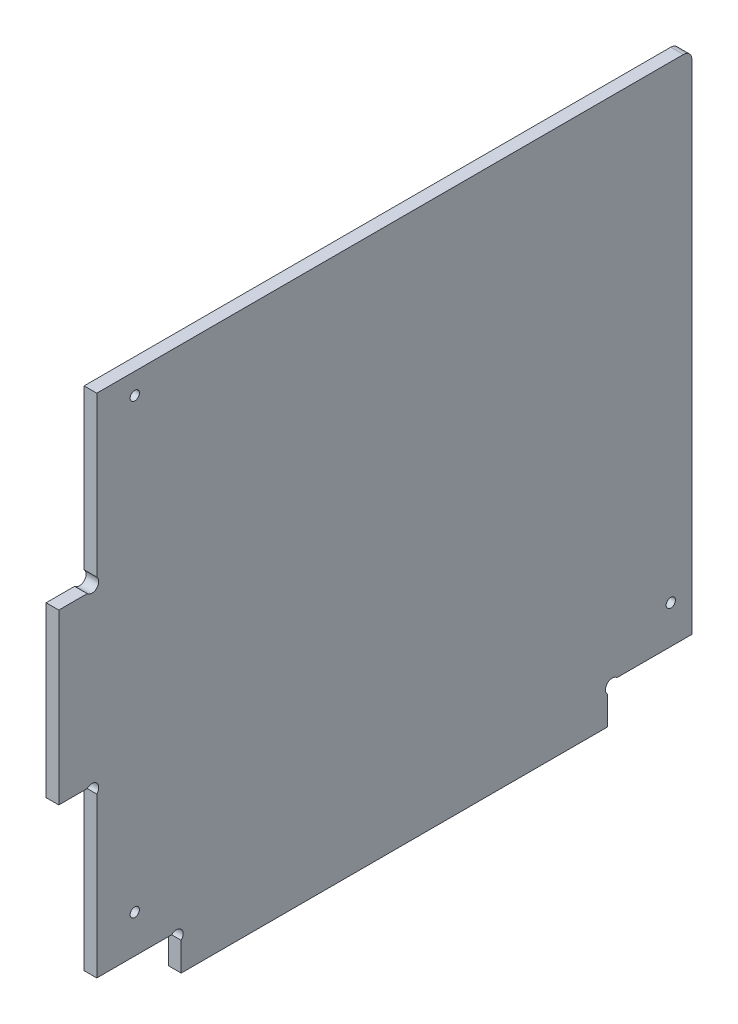
ISO-10303-21;
HEADER;
FILE_DESCRIPTION(('STEP AP214'),'2;1');
FILE_NAME('part.step','',(''),(''),'','','');
FILE_SCHEMA(('AUTOMOTIVE_DESIGN { 1 0 10303 214 1 1 1 1 }'));
ENDSEC;
DATA;
#1=APPLICATION_CONTEXT('core data for automotive mechanical design processes');
#2=APPLICATION_PROTOCOL_DEFINITION('international standard','automotive_design',2000,#1);
#3=PRODUCT_CONTEXT('',#1,'mechanical');
#4=PRODUCT('Part','Part','',(#3));
#5=PRODUCT_RELATED_PRODUCT_CATEGORY('part','',(#4));
#6=PRODUCT_DEFINITION_FORMATION('','',#4);
#7=PRODUCT_DEFINITION_CONTEXT('part definition',#1,'design');
#8=PRODUCT_DEFINITION('design','',#6,#7);
#9=PRODUCT_DEFINITION_SHAPE('','',#8);
#10=(LENGTH_UNIT() NAMED_UNIT(*) SI_UNIT(.MILLI.,.METRE.));
#11=(NAMED_UNIT(*) PLANE_ANGLE_UNIT() SI_UNIT($,.RADIAN.));
#12=(NAMED_UNIT(*) SI_UNIT($,.STERADIAN.) SOLID_ANGLE_UNIT());
#13=UNCERTAINTY_MEASURE_WITH_UNIT(LENGTH_MEASURE(1.E-05),#10,'distance_accuracy_value','');
#14=(GEOMETRIC_REPRESENTATION_CONTEXT(3) GLOBAL_UNCERTAINTY_ASSIGNED_CONTEXT((#13)) GLOBAL_UNIT_ASSIGNED_CONTEXT((#10,
#11,#12)) REPRESENTATION_CONTEXT('',''));
#15=CARTESIAN_POINT('',(0.,0.,0.));
#16=DIRECTION('',(0.,0.,1.));
#17=DIRECTION('',(1.,0.,0.));
#18=AXIS2_PLACEMENT_3D('',#15,#16,#17);
#19=CARTESIAN_POINT('',(3.,7.8686291501015,-131.131370849898));
#20=DIRECTION('',(-1.,0.,0.));
#21=DIRECTION('',(0.,0.,1.));
#22=AXIS2_PLACEMENT_3D('',#19,#20,#21);
#23=CYLINDRICAL_SURFACE('',#22,1.6);
#24=CARTESIAN_POINT('',(0.,7.8686291501015,-131.131370849898));
#25=DIRECTION('',(-1.,0.,0.));
#26=DIRECTION('',(0.,0.,-1.));
#27=AXIS2_PLACEMENT_3D('',#24,#25,#26);
#28=CIRCLE('',#27,1.6);
#29=CARTESIAN_POINT('',(0.,6.73725830020302,-130.));
#30=VERTEX_POINT('',#29);
#31=CARTESIAN_POINT('',(0.,9.,-132.262741699797));
#32=VERTEX_POINT('',#31);
#33=EDGE_CURVE('E176',#30,#32,#28,.T.);
#34=ORIENTED_EDGE('',*,*,#33,.T.);
#35=DIRECTION('',(-1.,0.,0.));
#36=VECTOR('',#35,1.);
#37=CARTESIAN_POINT('',(3.,9.,-132.262741699797));
#38=LINE('',#37,#36);
#39=CARTESIAN_POINT('',(3.,9.,-132.262741699797));
#40=VERTEX_POINT('',#39);
#41=EDGE_CURVE('E158',#40,#32,#38,.T.);
#42=ORIENTED_EDGE('',*,*,#41,.F.);
#43=CARTESIAN_POINT('',(3.,7.8686291501015,-131.131370849898));
#44=DIRECTION('',(-1.,0.,0.));
#45=DIRECTION('',(0.,0.,-1.));
#46=AXIS2_PLACEMENT_3D('',#43,#44,#45);
#47=CIRCLE('',#46,1.6);
#48=CARTESIAN_POINT('',(3.,6.73725830020302,-130.));
#49=VERTEX_POINT('',#48);
#50=EDGE_CURVE('E164',#49,#40,#47,.T.);
#51=ORIENTED_EDGE('',*,*,#50,.F.);
#52=DIRECTION('',(-1.,0.,0.));
#53=VECTOR('',#52,1.);
#54=CARTESIAN_POINT('',(3.,6.73725830020302,-130.));
#55=LINE('',#54,#53);
#56=EDGE_CURVE('E220',#49,#30,#55,.T.);
#57=ORIENTED_EDGE('',*,*,#56,.T.);
#58=EDGE_LOOP('',(#34,#42,#51,#57));
#59=FACE_BOUND('',#58,.T.);
#60=ADVANCED_FACE('F35',(#59),#23,.F.);
#61=CARTESIAN_POINT('',(3.,8.99999999999999,-150.));
#62=DIRECTION('',(0.,1.,0.));
#63=DIRECTION('',(0.,0.,1.));
#64=AXIS2_PLACEMENT_3D('',#61,#62,#63);
#65=PLANE('',#64);
#66=DIRECTION('',(0.,0.,-1.));
#67=VECTOR('',#66,1.);
#68=CARTESIAN_POINT('',(0.,8.99999999999999,-150.));
#69=LINE('',#68,#67);
#70=CARTESIAN_POINT('',(0.,8.99999999999999,-150.));
#71=VERTEX_POINT('',#70);
#72=EDGE_CURVE('E249',#32,#71,#69,.T.);
#73=ORIENTED_EDGE('',*,*,#72,.T.);
#74=DIRECTION('',(-1.,0.,0.));
#75=VECTOR('',#74,1.);
#76=CARTESIAN_POINT('',(3.,8.99999999999999,-150.));
#77=LINE('',#76,#75);
#78=CARTESIAN_POINT('',(3.,8.99999999999999,-150.));
#79=VERTEX_POINT('',#78);
#80=EDGE_CURVE('E161',#79,#71,#77,.T.);
#81=ORIENTED_EDGE('',*,*,#80,.F.);
#82=DIRECTION('',(0.,0.,-1.));
#83=VECTOR('',#82,1.);
#84=CARTESIAN_POINT('',(3.,8.99999999999999,-150.));
#85=LINE('',#84,#83);
#86=EDGE_CURVE('E154',#40,#79,#85,.T.);
#87=ORIENTED_EDGE('',*,*,#86,.F.);
#88=ORIENTED_EDGE('',*,*,#41,.T.);
#89=EDGE_LOOP('',(#73,#81,#87,#88));
#90=FACE_BOUND('',#89,.T.);
#91=ADVANCED_FACE('F156',(#90),#65,.F.);
#92=CARTESIAN_POINT('',(3.,129.,-150.));
#93=DIRECTION('',(0.,0.,1.));
#94=DIRECTION('',(0.,-1.,0.));
#95=AXIS2_PLACEMENT_3D('',#92,#93,#94);
#96=PLANE('',#95);
#97=DIRECTION('',(0.,1.,0.));
#98=VECTOR('',#97,1.);
#99=CARTESIAN_POINT('',(0.,129.,-150.));
#100=LINE('',#99,#98);
#101=CARTESIAN_POINT('',(0.,127.,-150.));
#102=VERTEX_POINT('',#101);
#103=EDGE_CURVE('E247',#71,#102,#100,.T.);
#104=ORIENTED_EDGE('',*,*,#103,.T.);
#105=DIRECTION('',(-1.,0.,0.));
#106=VECTOR('',#105,1.);
#107=CARTESIAN_POINT('',(3.,127.,-150.));
#108=LINE('',#107,#106);
#109=CARTESIAN_POINT('',(3.,127.,-150.));
#110=VERTEX_POINT('',#109);
#111=EDGE_CURVE('E43',#102,#110,#108,.F.);
#112=ORIENTED_EDGE('',*,*,#111,.T.);
#113=DIRECTION('',(0.,1.,0.));
#114=VECTOR('',#113,1.);
#115=CARTESIAN_POINT('',(3.,129.,-150.));
#116=LINE('',#115,#114);
#117=EDGE_CURVE('E163',#79,#110,#116,.T.);
#118=ORIENTED_EDGE('',*,*,#117,.F.);
#119=ORIENTED_EDGE('',*,*,#80,.T.);
#120=EDGE_LOOP('',(#104,#112,#118,#119));
#121=FACE_BOUND('',#120,.T.);
#122=ADVANCED_FACE('F331',(#121),#96,.F.);
#123=CARTESIAN_POINT('',(3.,129.,-8.99999999999997));
#124=DIRECTION('',(0.,-1.,0.));
#125=DIRECTION('',(0.,0.,-1.));
#126=AXIS2_PLACEMENT_3D('',#123,#124,#125);
#127=PLANE('',#126);
#128=DIRECTION('',(0.,0.,1.));
#129=VECTOR('',#128,1.);
#130=CARTESIAN_POINT('',(3.,129.,-8.99999999999997));
#131=LINE('',#130,#129);
#132=CARTESIAN_POINT('',(3.,129.,-148.));
#133=VERTEX_POINT('',#132);
#134=CARTESIAN_POINT('',(3.,129.,-8.99999999999997));
#135=VERTEX_POINT('',#134);
#136=EDGE_CURVE('E276',#133,#135,#131,.T.);
#137=ORIENTED_EDGE('',*,*,#136,.F.);
#138=DIRECTION('',(-1.,0.,0.));
#139=VECTOR('',#138,1.);
#140=CARTESIAN_POINT('',(3.,129.,-148.));
#141=LINE('',#140,#139);
#142=CARTESIAN_POINT('',(0.,129.,-148.));
#143=VERTEX_POINT('',#142);
#144=EDGE_CURVE('E177',#133,#143,#141,.T.);
#145=ORIENTED_EDGE('',*,*,#144,.T.);
#146=DIRECTION('',(0.,0.,1.));
#147=VECTOR('',#146,1.);
#148=CARTESIAN_POINT('',(0.,129.,-8.99999999999997));
#149=LINE('',#148,#147);
#150=CARTESIAN_POINT('',(0.,129.,-8.99999999999997));
#151=VERTEX_POINT('',#150);
#152=EDGE_CURVE('E245',#143,#151,#149,.T.);
#153=ORIENTED_EDGE('',*,*,#152,.T.);
#154=DIRECTION('',(-1.,0.,0.));
#155=VECTOR('',#154,1.);
#156=CARTESIAN_POINT('',(3.,129.,-8.99999999999997));
#157=LINE('',#156,#155);
#158=EDGE_CURVE('E181',#135,#151,#157,.T.);
#159=ORIENTED_EDGE('',*,*,#158,.F.);
#160=EDGE_LOOP('',(#137,#145,#153,#159));
#161=FACE_BOUND('',#160,.T.);
#162=ADVANCED_FACE('F336',(#161),#127,.F.);
#163=CARTESIAN_POINT('',(3.,91.2627416997969,-8.99999999999998));
#164=DIRECTION('',(0.,0.,-1.));
#165=DIRECTION('',(0.,1.,0.));
#166=AXIS2_PLACEMENT_3D('',#163,#164,#165);
#167=PLANE('',#166);
#168=DIRECTION('',(0.,-1.,0.));
#169=VECTOR('',#168,1.);
#170=CARTESIAN_POINT('',(0.,91.2627416997969,-8.99999999999998));
#171=LINE('',#170,#169);
#172=CARTESIAN_POINT('',(0.,91.2627416997969,-8.99999999999998));
#173=VERTEX_POINT('',#172);
#174=EDGE_CURVE('E243',#151,#173,#171,.T.);
#175=ORIENTED_EDGE('',*,*,#174,.T.);
#176=DIRECTION('',(-1.,0.,0.));
#177=VECTOR('',#176,1.);
#178=CARTESIAN_POINT('',(3.,91.2627416997969,-8.99999999999998));
#179=LINE('',#178,#177);
#180=CARTESIAN_POINT('',(3.,91.2627416997969,-8.99999999999998));
#181=VERTEX_POINT('',#180);
#182=EDGE_CURVE('E187',#181,#173,#179,.T.);
#183=ORIENTED_EDGE('',*,*,#182,.F.);
#184=DIRECTION('',(0.,-1.,0.));
#185=VECTOR('',#184,1.);
#186=CARTESIAN_POINT('',(3.,91.2627416997969,-8.99999999999998));
#187=LINE('',#186,#185);
#188=EDGE_CURVE('E274',#135,#181,#187,.T.);
#189=ORIENTED_EDGE('',*,*,#188,.F.);
#190=ORIENTED_EDGE('',*,*,#158,.T.);
#191=EDGE_LOOP('',(#175,#183,#189,#190));
#192=FACE_BOUND('',#191,.T.);
#193=ADVANCED_FACE('F339',(#192),#167,.F.);
#194=CARTESIAN_POINT('',(3.,90.1313708498985,-7.86862915010151));
#195=DIRECTION('',(-1.,0.,0.));
#196=DIRECTION('',(0.,0.,1.));
#197=AXIS2_PLACEMENT_3D('',#194,#195,#196);
#198=CYLINDRICAL_SURFACE('',#197,1.6);
#199=CARTESIAN_POINT('',(0.,90.1313708498985,-7.86862915010151));
#200=DIRECTION('',(-1.,0.,0.));
#201=DIRECTION('',(0.,0.,1.));
#202=AXIS2_PLACEMENT_3D('',#199,#200,#201);
#203=CIRCLE('',#202,1.6);
#204=CARTESIAN_POINT('',(0.,89.,-6.73725830020303));
#205=VERTEX_POINT('',#204);
#206=EDGE_CURVE('E241',#173,#205,#203,.T.);
#207=ORIENTED_EDGE('',*,*,#206,.T.);
#208=DIRECTION('',(-1.,0.,0.));
#209=VECTOR('',#208,1.);
#210=CARTESIAN_POINT('',(3.,89.,-6.73725830020303));
#211=LINE('',#210,#209);
#212=CARTESIAN_POINT('',(3.,89.,-6.73725830020303));
#213=VERTEX_POINT('',#212);
#214=EDGE_CURVE('E190',#213,#205,#211,.T.);
#215=ORIENTED_EDGE('',*,*,#214,.F.);
#216=CARTESIAN_POINT('',(3.,90.1313708498985,-7.86862915010151));
#217=DIRECTION('',(-1.,0.,0.));
#218=DIRECTION('',(0.,0.,1.));
#219=AXIS2_PLACEMENT_3D('',#216,#217,#218);
#220=CIRCLE('',#219,1.6);
#221=EDGE_CURVE('E272',#181,#213,#220,.T.);
#222=ORIENTED_EDGE('',*,*,#221,.F.);
#223=ORIENTED_EDGE('',*,*,#182,.T.);
#224=EDGE_LOOP('',(#207,#215,#222,#223));
#225=FACE_BOUND('',#224,.T.);
#226=ADVANCED_FACE('F343',(#225),#198,.F.);
#227=CARTESIAN_POINT('',(3.,89.,0.));
#228=DIRECTION('',(0.,-1.,0.));
#229=DIRECTION('',(0.,0.,-1.));
#230=AXIS2_PLACEMENT_3D('',#227,#228,#229);
#231=PLANE('',#230);
#232=DIRECTION('',(0.,0.,1.));
#233=VECTOR('',#232,1.);
#234=CARTESIAN_POINT('',(0.,89.,0.));
#235=LINE('',#234,#233);
#236=CARTESIAN_POINT('',(0.,89.,0.));
#237=VERTEX_POINT('',#236);
#238=EDGE_CURVE('E239',#205,#237,#235,.T.);
#239=ORIENTED_EDGE('',*,*,#238,.T.);
#240=DIRECTION('',(-1.,0.,0.));
#241=VECTOR('',#240,1.);
#242=CARTESIAN_POINT('',(3.,89.,0.));
#243=LINE('',#242,#241);
#244=CARTESIAN_POINT('',(3.,89.,0.));
#245=VERTEX_POINT('',#244);
#246=EDGE_CURVE('E193',#245,#237,#243,.T.);
#247=ORIENTED_EDGE('',*,*,#246,.F.);
#248=DIRECTION('',(0.,0.,1.));
#249=VECTOR('',#248,1.);
#250=CARTESIAN_POINT('',(3.,89.,0.));
#251=LINE('',#250,#249);
#252=EDGE_CURVE('E270',#213,#245,#251,.T.);
#253=ORIENTED_EDGE('',*,*,#252,.F.);
#254=ORIENTED_EDGE('',*,*,#214,.T.);
#255=EDGE_LOOP('',(#239,#247,#253,#254));
#256=FACE_BOUND('',#255,.T.);
#257=ADVANCED_FACE('F347',(#256),#231,.F.);
#258=CARTESIAN_POINT('',(3.,49.,0.));
#259=DIRECTION('',(0.,0.,-1.));
#260=DIRECTION('',(-1.,0.,0.));
#261=AXIS2_PLACEMENT_3D('',#258,#259,#260);
#262=PLANE('',#261);
#263=DIRECTION('',(0.,-1.,0.));
#264=VECTOR('',#263,1.);
#265=CARTESIAN_POINT('',(0.,49.,0.));
#266=LINE('',#265,#264);
#267=CARTESIAN_POINT('',(0.,49.,0.));
#268=VERTEX_POINT('',#267);
#269=EDGE_CURVE('E237',#237,#268,#266,.T.);
#270=ORIENTED_EDGE('',*,*,#269,.T.);
#271=DIRECTION('',(-1.,0.,0.));
#272=VECTOR('',#271,1.);
#273=CARTESIAN_POINT('',(3.,49.,0.));
#274=LINE('',#273,#272);
#275=CARTESIAN_POINT('',(3.,49.,0.));
#276=VERTEX_POINT('',#275);
#277=EDGE_CURVE('E196',#276,#268,#274,.T.);
#278=ORIENTED_EDGE('',*,*,#277,.F.);
#279=DIRECTION('',(0.,-1.,0.));
#280=VECTOR('',#279,1.);
#281=CARTESIAN_POINT('',(3.,49.,0.));
#282=LINE('',#281,#280);
#283=EDGE_CURVE('E268',#245,#276,#282,.T.);
#284=ORIENTED_EDGE('',*,*,#283,.F.);
#285=ORIENTED_EDGE('',*,*,#246,.T.);
#286=EDGE_LOOP('',(#270,#278,#284,#285));
#287=FACE_BOUND('',#286,.T.);
#288=ADVANCED_FACE('F351',(#287),#262,.F.);
#289=CARTESIAN_POINT('',(3.,49.,0.));
#290=DIRECTION('',(0.,1.,0.));
#291=DIRECTION('',(0.,0.,1.));
#292=AXIS2_PLACEMENT_3D('',#289,#290,#291);
#293=PLANE('',#292);
#294=DIRECTION('',(0.,0.,-1.));
#295=VECTOR('',#294,1.);
#296=CARTESIAN_POINT('',(0.,49.,0.));
#297=LINE('',#296,#295);
#298=CARTESIAN_POINT('',(0.,49.,-6.73725830020302));
#299=VERTEX_POINT('',#298);
#300=EDGE_CURVE('E235',#268,#299,#297,.T.);
#301=ORIENTED_EDGE('',*,*,#300,.T.);
#302=DIRECTION('',(-1.,0.,0.));
#303=VECTOR('',#302,1.);
#304=CARTESIAN_POINT('',(3.,49.,-6.73725830020302));
#305=LINE('',#304,#303);
#306=CARTESIAN_POINT('',(3.,49.,-6.73725830020302));
#307=VERTEX_POINT('',#306);
#308=EDGE_CURVE('E199',#307,#299,#305,.T.);
#309=ORIENTED_EDGE('',*,*,#308,.F.);
#310=DIRECTION('',(0.,0.,-1.));
#311=VECTOR('',#310,1.);
#312=CARTESIAN_POINT('',(3.,49.,0.));
#313=LINE('',#312,#311);
#314=EDGE_CURVE('E266',#276,#307,#313,.T.);
#315=ORIENTED_EDGE('',*,*,#314,.F.);
#316=ORIENTED_EDGE('',*,*,#277,.T.);
#317=EDGE_LOOP('',(#301,#309,#315,#316));
#318=FACE_BOUND('',#317,.T.);
#319=ADVANCED_FACE('F355',(#318),#293,.F.);
#320=CARTESIAN_POINT('',(3.,47.8686291501015,-7.86862915010151));
#321=DIRECTION('',(-1.,0.,0.));
#322=DIRECTION('',(0.,0.,1.));
#323=AXIS2_PLACEMENT_3D('',#320,#321,#322);
#324=CYLINDRICAL_SURFACE('',#323,1.6);
#325=CARTESIAN_POINT('',(0.,47.8686291501015,-7.86862915010151));
#326=DIRECTION('',(-1.,0.,0.));
#327=DIRECTION('',(0.,0.,-1.));
#328=AXIS2_PLACEMENT_3D('',#325,#326,#327);
#329=CIRCLE('',#328,1.6);
#330=CARTESIAN_POINT('',(0.,46.7372583002031,-8.99999999999999));
#331=VERTEX_POINT('',#330);
#332=EDGE_CURVE('E233',#299,#331,#329,.T.);
#333=ORIENTED_EDGE('',*,*,#332,.T.);
#334=DIRECTION('',(-1.,0.,0.));
#335=VECTOR('',#334,1.);
#336=CARTESIAN_POINT('',(3.,46.7372583002031,-8.99999999999999));
#337=LINE('',#336,#335);
#338=CARTESIAN_POINT('',(3.,46.7372583002031,-8.99999999999999));
#339=VERTEX_POINT('',#338);
#340=EDGE_CURVE('E202',#339,#331,#337,.T.);
#341=ORIENTED_EDGE('',*,*,#340,.F.);
#342=CARTESIAN_POINT('',(3.,47.8686291501015,-7.86862915010151));
#343=DIRECTION('',(-1.,0.,0.));
#344=DIRECTION('',(0.,0.,-1.));
#345=AXIS2_PLACEMENT_3D('',#342,#343,#344);
#346=CIRCLE('',#345,1.6);
#347=EDGE_CURVE('E264',#307,#339,#346,.T.);
#348=ORIENTED_EDGE('',*,*,#347,.F.);
#349=ORIENTED_EDGE('',*,*,#308,.T.);
#350=EDGE_LOOP('',(#333,#341,#348,#349));
#351=FACE_BOUND('',#350,.T.);
#352=ADVANCED_FACE('F359',(#351),#324,.F.);
#353=CARTESIAN_POINT('',(3.,8.99999999999998,-9.));
#354=DIRECTION('',(0.,0.,-1.));
#355=DIRECTION('',(0.,1.,0.));
#356=AXIS2_PLACEMENT_3D('',#353,#354,#355);
#357=PLANE('',#356);
#358=DIRECTION('',(0.,-1.,0.));
#359=VECTOR('',#358,1.);
#360=CARTESIAN_POINT('',(0.,8.99999999999998,-9.));
#361=LINE('',#360,#359);
#362=CARTESIAN_POINT('',(0.,8.99999999999998,-9.));
#363=VERTEX_POINT('',#362);
#364=EDGE_CURVE('E231',#331,#363,#361,.T.);
#365=ORIENTED_EDGE('',*,*,#364,.T.);
#366=DIRECTION('',(-1.,0.,0.));
#367=VECTOR('',#366,1.);
#368=CARTESIAN_POINT('',(3.,8.99999999999998,-9.));
#369=LINE('',#368,#367);
#370=CARTESIAN_POINT('',(3.,8.99999999999998,-9.));
#371=VERTEX_POINT('',#370);
#372=EDGE_CURVE('E205',#371,#363,#369,.T.);
#373=ORIENTED_EDGE('',*,*,#372,.F.);
#374=DIRECTION('',(0.,-1.,0.));
#375=VECTOR('',#374,1.);
#376=CARTESIAN_POINT('',(3.,8.99999999999998,-9.));
#377=LINE('',#376,#375);
#378=EDGE_CURVE('E262',#339,#371,#377,.T.);
#379=ORIENTED_EDGE('',*,*,#378,.F.);
#380=ORIENTED_EDGE('',*,*,#340,.T.);
#381=EDGE_LOOP('',(#365,#373,#379,#380));
#382=FACE_BOUND('',#381,.T.);
#383=ADVANCED_FACE('F363',(#382),#357,.F.);
#384=CARTESIAN_POINT('',(3.,8.99999999999998,-26.737258300203));
#385=DIRECTION('',(0.,1.,0.));
#386=DIRECTION('',(0.,0.,1.));
#387=AXIS2_PLACEMENT_3D('',#384,#385,#386);
#388=PLANE('',#387);
#389=DIRECTION('',(0.,0.,-1.));
#390=VECTOR('',#389,1.);
#391=CARTESIAN_POINT('',(0.,8.99999999999998,-26.737258300203));
#392=LINE('',#391,#390);
#393=CARTESIAN_POINT('',(0.,8.99999999999998,-26.737258300203));
#394=VERTEX_POINT('',#393);
#395=EDGE_CURVE('E229',#363,#394,#392,.T.);
#396=ORIENTED_EDGE('',*,*,#395,.T.);
#397=DIRECTION('',(-1.,0.,0.));
#398=VECTOR('',#397,1.);
#399=CARTESIAN_POINT('',(3.,8.99999999999998,-26.737258300203));
#400=LINE('',#399,#398);
#401=CARTESIAN_POINT('',(3.,8.99999999999998,-26.737258300203));
#402=VERTEX_POINT('',#401);
#403=EDGE_CURVE('E208',#402,#394,#400,.T.);
#404=ORIENTED_EDGE('',*,*,#403,.F.);
#405=DIRECTION('',(0.,0.,-1.));
#406=VECTOR('',#405,1.);
#407=CARTESIAN_POINT('',(3.,8.99999999999998,-26.737258300203));
#408=LINE('',#407,#406);
#409=EDGE_CURVE('E260',#371,#402,#408,.T.);
#410=ORIENTED_EDGE('',*,*,#409,.F.);
#411=ORIENTED_EDGE('',*,*,#372,.T.);
#412=EDGE_LOOP('',(#396,#404,#410,#411));
#413=FACE_BOUND('',#412,.T.);
#414=ADVANCED_FACE('F367',(#413),#388,.F.);
#415=CARTESIAN_POINT('',(3.,7.8686291501015,-27.8686291501015));
#416=DIRECTION('',(-1.,0.,0.));
#417=DIRECTION('',(0.,0.,1.));
#418=AXIS2_PLACEMENT_3D('',#415,#416,#417);
#419=CYLINDRICAL_SURFACE('',#418,1.6);
#420=CARTESIAN_POINT('',(0.,7.8686291501015,-27.8686291501015));
#421=DIRECTION('',(-1.,0.,0.));
#422=DIRECTION('',(0.,0.,1.));
#423=AXIS2_PLACEMENT_3D('',#420,#421,#422);
#424=CIRCLE('',#423,1.6);
#425=CARTESIAN_POINT('',(0.,6.73725830020306,-29.));
#426=VERTEX_POINT('',#425);
#427=EDGE_CURVE('E227',#394,#426,#424,.T.);
#428=ORIENTED_EDGE('',*,*,#427,.T.);
#429=DIRECTION('',(-1.,0.,0.));
#430=VECTOR('',#429,1.);
#431=CARTESIAN_POINT('',(3.,6.73725830020306,-29.));
#432=LINE('',#431,#430);
#433=CARTESIAN_POINT('',(3.,6.73725830020306,-29.));
#434=VERTEX_POINT('',#433);
#435=EDGE_CURVE('E211',#434,#426,#432,.T.);
#436=ORIENTED_EDGE('',*,*,#435,.F.);
#437=CARTESIAN_POINT('',(3.,7.8686291501015,-27.8686291501015));
#438=DIRECTION('',(-1.,0.,0.));
#439=DIRECTION('',(0.,0.,1.));
#440=AXIS2_PLACEMENT_3D('',#437,#438,#439);
#441=CIRCLE('',#440,1.6);
#442=EDGE_CURVE('E258',#402,#434,#441,.T.);
#443=ORIENTED_EDGE('',*,*,#442,.F.);
#444=ORIENTED_EDGE('',*,*,#403,.T.);
#445=EDGE_LOOP('',(#428,#436,#443,#444));
#446=FACE_BOUND('',#445,.T.);
#447=ADVANCED_FACE('F371',(#446),#419,.F.);
#448=CARTESIAN_POINT('',(3.,6.73725830020306,-29.));
#449=DIRECTION('',(0.,0.,-1.));
#450=DIRECTION('',(0.,1.,0.));
#451=AXIS2_PLACEMENT_3D('',#448,#449,#450);
#452=PLANE('',#451);
#453=DIRECTION('',(0.,-1.,0.));
#454=VECTOR('',#453,1.);
#455=CARTESIAN_POINT('',(0.,6.73725830020306,-29.));
#456=LINE('',#455,#454);
#457=CARTESIAN_POINT('',(0.,0.,-29.));
#458=VERTEX_POINT('',#457);
#459=EDGE_CURVE('E225',#426,#458,#456,.T.);
#460=ORIENTED_EDGE('',*,*,#459,.T.);
#461=DIRECTION('',(-1.,0.,0.));
#462=VECTOR('',#461,1.);
#463=CARTESIAN_POINT('',(3.,0.,-29.));
#464=LINE('',#463,#462);
#465=CARTESIAN_POINT('',(3.,0.,-29.));
#466=VERTEX_POINT('',#465);
#467=EDGE_CURVE('E214',#466,#458,#464,.T.);
#468=ORIENTED_EDGE('',*,*,#467,.F.);
#469=DIRECTION('',(0.,-1.,0.));
#470=VECTOR('',#469,1.);
#471=CARTESIAN_POINT('',(3.,6.73725830020306,-29.));
#472=LINE('',#471,#470);
#473=EDGE_CURVE('E256',#434,#466,#472,.T.);
#474=ORIENTED_EDGE('',*,*,#473,.F.);
#475=ORIENTED_EDGE('',*,*,#435,.T.);
#476=EDGE_LOOP('',(#460,#468,#474,#475));
#477=FACE_BOUND('',#476,.T.);
#478=ADVANCED_FACE('F375',(#477),#452,.F.);
#479=CARTESIAN_POINT('',(3.,0.,-29.));
#480=DIRECTION('',(0.,1.,0.));
#481=DIRECTION('',(0.,0.,1.));
#482=AXIS2_PLACEMENT_3D('',#479,#480,#481);
#483=PLANE('',#482);
#484=DIRECTION('',(0.,0.,-1.));
#485=VECTOR('',#484,1.);
#486=CARTESIAN_POINT('',(0.,0.,-29.));
#487=LINE('',#486,#485);
#488=CARTESIAN_POINT('',(0.,0.,-130.));
#489=VERTEX_POINT('',#488);
#490=EDGE_CURVE('E223',#458,#489,#487,.T.);
#491=ORIENTED_EDGE('',*,*,#490,.T.);
#492=DIRECTION('',(-1.,0.,0.));
#493=VECTOR('',#492,1.);
#494=CARTESIAN_POINT('',(3.,0.,-130.));
#495=LINE('',#494,#493);
#496=CARTESIAN_POINT('',(3.,0.,-130.));
#497=VERTEX_POINT('',#496);
#498=EDGE_CURVE('E217',#497,#489,#495,.T.);
#499=ORIENTED_EDGE('',*,*,#498,.F.);
#500=DIRECTION('',(0.,0.,-1.));
#501=VECTOR('',#500,1.);
#502=CARTESIAN_POINT('',(3.,0.,-29.));
#503=LINE('',#502,#501);
#504=EDGE_CURVE('E254',#466,#497,#503,.T.);
#505=ORIENTED_EDGE('',*,*,#504,.F.);
#506=ORIENTED_EDGE('',*,*,#467,.T.);
#507=EDGE_LOOP('',(#491,#499,#505,#506));
#508=FACE_BOUND('',#507,.T.);
#509=ADVANCED_FACE('F379',(#508),#483,.F.);
#510=CARTESIAN_POINT('',(3.,6.73725830020302,-130.));
#511=DIRECTION('',(0.,0.,1.));
#512=DIRECTION('',(0.,-1.,0.));
#513=AXIS2_PLACEMENT_3D('',#510,#511,#512);
#514=PLANE('',#513);
#515=DIRECTION('',(0.,1.,0.));
#516=VECTOR('',#515,1.);
#517=CARTESIAN_POINT('',(0.,6.73725830020302,-130.));
#518=LINE('',#517,#516);
#519=EDGE_CURVE('E173',#489,#30,#518,.T.);
#520=ORIENTED_EDGE('',*,*,#519,.T.);
#521=ORIENTED_EDGE('',*,*,#56,.F.);
#522=DIRECTION('',(0.,1.,0.));
#523=VECTOR('',#522,1.);
#524=CARTESIAN_POINT('',(3.,6.73725830020302,-130.));
#525=LINE('',#524,#523);
#526=EDGE_CURVE('E169',#497,#49,#525,.T.);
#527=ORIENTED_EDGE('',*,*,#526,.F.);
#528=ORIENTED_EDGE('',*,*,#498,.T.);
#529=EDGE_LOOP('',(#520,#521,#527,#528));
#530=FACE_BOUND('',#529,.T.);
#531=ADVANCED_FACE('F309',(#530),#514,.F.);
#532=CARTESIAN_POINT('',(3.,7.8686291501015,-131.131370849898));
#533=DIRECTION('',(1.,0.,0.));
#534=DIRECTION('',(0.,0.,-1.));
#535=AXIS2_PLACEMENT_3D('',#532,#533,#534);
#536=PLANE('',#535);
#537=CARTESIAN_POINT('',(3.,124.,-18.));
#538=DIRECTION('',(1.,0.,0.));
#539=DIRECTION('',(0.,0.,-1.));
#540=AXIS2_PLACEMENT_3D('',#537,#538,#539);
#541=CIRCLE('',#540,1.1);
#542=CARTESIAN_POINT('',(3.,124.,-19.1));
#543=VERTEX_POINT('',#542);
#544=EDGE_CURVE('E291',#543,#543,#541,.T.);
#545=ORIENTED_EDGE('',*,*,#544,.F.);
#546=EDGE_LOOP('',(#545));
#547=FACE_BOUND('',#546,.T.);
#548=CARTESIAN_POINT('',(3.,18.,-18.));
#549=DIRECTION('',(1.,0.,0.));
#550=DIRECTION('',(0.,0.,-1.));
#551=AXIS2_PLACEMENT_3D('',#548,#549,#550);
#552=CIRCLE('',#551,1.1);
#553=CARTESIAN_POINT('',(3.,18.,-19.1));
#554=VERTEX_POINT('',#553);
#555=EDGE_CURVE('E285',#554,#554,#552,.T.);
#556=ORIENTED_EDGE('',*,*,#555,.F.);
#557=EDGE_LOOP('',(#556));
#558=FACE_BOUND('',#557,.T.);
#559=CARTESIAN_POINT('',(3.,18.,-145.));
#560=DIRECTION('',(1.,0.,0.));
#561=DIRECTION('',(0.,0.,-1.));
#562=AXIS2_PLACEMENT_3D('',#559,#560,#561);
#563=CIRCLE('',#562,1.09999999999999);
#564=CARTESIAN_POINT('',(3.,18.,-146.1));
#565=VERTEX_POINT('',#564);
#566=EDGE_CURVE('E279',#565,#565,#563,.T.);
#567=ORIENTED_EDGE('',*,*,#566,.F.);
#568=EDGE_LOOP('',(#567));
#569=FACE_BOUND('',#568,.T.);
#570=ORIENTED_EDGE('',*,*,#117,.T.);
#571=CARTESIAN_POINT('',(3.,127.,-148.));
#572=DIRECTION('',(1.,0.,0.));
#573=DIRECTION('',(0.,0.,-1.));
#574=AXIS2_PLACEMENT_3D('',#571,#572,#573);
#575=CIRCLE('',#574,2.);
#576=EDGE_CURVE('E11',#110,#133,#575,.T.);
#577=ORIENTED_EDGE('',*,*,#576,.T.);
#578=ORIENTED_EDGE('',*,*,#136,.T.);
#579=ORIENTED_EDGE('',*,*,#188,.T.);
#580=ORIENTED_EDGE('',*,*,#221,.T.);
#581=ORIENTED_EDGE('',*,*,#252,.T.);
#582=ORIENTED_EDGE('',*,*,#283,.T.);
#583=ORIENTED_EDGE('',*,*,#314,.T.);
#584=ORIENTED_EDGE('',*,*,#347,.T.);
#585=ORIENTED_EDGE('',*,*,#378,.T.);
#586=ORIENTED_EDGE('',*,*,#409,.T.);
#587=ORIENTED_EDGE('',*,*,#442,.T.);
#588=ORIENTED_EDGE('',*,*,#473,.T.);
#589=ORIENTED_EDGE('',*,*,#504,.T.);
#590=ORIENTED_EDGE('',*,*,#526,.T.);
#591=ORIENTED_EDGE('',*,*,#50,.T.);
#592=ORIENTED_EDGE('',*,*,#86,.T.);
#593=EDGE_LOOP('',(#570,#577,#578,#579,#580,#581,#582,#583,#584,#585,#586,#587,#588,#589,#590,
#591,#592));
#594=FACE_BOUND('',#593,.T.);
#595=ADVANCED_FACE('F167',(#547,#558,#569,#594),#536,.T.);
#596=CARTESIAN_POINT('',(0.,7.8686291501015,-131.131370849898));
#597=DIRECTION('',(1.,0.,0.));
#598=DIRECTION('',(0.,0.,-1.));
#599=AXIS2_PLACEMENT_3D('',#596,#597,#598);
#600=PLANE('',#599);
#601=CARTESIAN_POINT('',(0.,124.,-18.));
#602=DIRECTION('',(1.,0.,0.));
#603=DIRECTION('',(0.,0.,-1.));
#604=AXIS2_PLACEMENT_3D('',#601,#602,#603);
#605=CIRCLE('',#604,1.1);
#606=CARTESIAN_POINT('',(0.,124.,-19.1));
#607=VERTEX_POINT('',#606);
#608=EDGE_CURVE('E252',#607,#607,#605,.T.);
#609=ORIENTED_EDGE('',*,*,#608,.T.);
#610=EDGE_LOOP('',(#609));
#611=FACE_BOUND('',#610,.T.);
#612=CARTESIAN_POINT('',(0.,18.,-18.));
#613=DIRECTION('',(1.,0.,0.));
#614=DIRECTION('',(0.,0.,-1.));
#615=AXIS2_PLACEMENT_3D('',#612,#613,#614);
#616=CIRCLE('',#615,1.1);
#617=CARTESIAN_POINT('',(0.,18.,-19.1));
#618=VERTEX_POINT('',#617);
#619=EDGE_CURVE('E288',#618,#618,#616,.T.);
#620=ORIENTED_EDGE('',*,*,#619,.T.);
#621=EDGE_LOOP('',(#620));
#622=FACE_BOUND('',#621,.T.);
#623=CARTESIAN_POINT('',(0.,18.,-145.));
#624=DIRECTION('',(1.,0.,0.));
#625=DIRECTION('',(0.,0.,-1.));
#626=AXIS2_PLACEMENT_3D('',#623,#624,#625);
#627=CIRCLE('',#626,1.09999999999999);
#628=CARTESIAN_POINT('',(0.,18.,-146.1));
#629=VERTEX_POINT('',#628);
#630=EDGE_CURVE('E282',#629,#629,#627,.T.);
#631=ORIENTED_EDGE('',*,*,#630,.T.);
#632=EDGE_LOOP('',(#631));
#633=FACE_BOUND('',#632,.T.);
#634=ORIENTED_EDGE('',*,*,#152,.F.);
#635=CARTESIAN_POINT('',(0.,127.,-148.));
#636=DIRECTION('',(1.,0.,0.));
#637=DIRECTION('',(0.,0.,-1.));
#638=AXIS2_PLACEMENT_3D('',#635,#636,#637);
#639=CIRCLE('',#638,2.);
#640=EDGE_CURVE('E57',#143,#102,#639,.F.);
#641=ORIENTED_EDGE('',*,*,#640,.T.);
#642=ORIENTED_EDGE('',*,*,#103,.F.);
#643=ORIENTED_EDGE('',*,*,#72,.F.);
#644=ORIENTED_EDGE('',*,*,#33,.F.);
#645=ORIENTED_EDGE('',*,*,#519,.F.);
#646=ORIENTED_EDGE('',*,*,#490,.F.);
#647=ORIENTED_EDGE('',*,*,#459,.F.);
#648=ORIENTED_EDGE('',*,*,#427,.F.);
#649=ORIENTED_EDGE('',*,*,#395,.F.);
#650=ORIENTED_EDGE('',*,*,#364,.F.);
#651=ORIENTED_EDGE('',*,*,#332,.F.);
#652=ORIENTED_EDGE('',*,*,#300,.F.);
#653=ORIENTED_EDGE('',*,*,#269,.F.);
#654=ORIENTED_EDGE('',*,*,#238,.F.);
#655=ORIENTED_EDGE('',*,*,#206,.F.);
#656=ORIENTED_EDGE('',*,*,#174,.F.);
#657=EDGE_LOOP('',(#634,#641,#642,#643,#644,#645,#646,#647,#648,#649,#650,#651,#652,#653,#654,
#655,#656));
#658=FACE_BOUND('',#657,.T.);
#659=ADVANCED_FACE('F297',(#611,#622,#633,#658),#600,.F.);
#660=CARTESIAN_POINT('',(0.,18.,-145.));
#661=DIRECTION('',(1.,0.,0.));
#662=DIRECTION('',(0.,0.,-1.));
#663=AXIS2_PLACEMENT_3D('',#660,#661,#662);
#664=CYLINDRICAL_SURFACE('',#663,1.09999999999999);
#665=ORIENTED_EDGE('',*,*,#630,.F.);
#666=EDGE_LOOP('',(#665));
#667=FACE_BOUND('',#666,.T.);
#668=ORIENTED_EDGE('',*,*,#566,.T.);
#669=EDGE_LOOP('',(#668));
#670=FACE_BOUND('',#669,.T.);
#671=ADVANCED_FACE('F315',(#667,#670),#664,.F.);
#672=CARTESIAN_POINT('',(0.,18.,-18.));
#673=DIRECTION('',(1.,0.,0.));
#674=DIRECTION('',(0.,0.,-1.));
#675=AXIS2_PLACEMENT_3D('',#672,#673,#674);
#676=CYLINDRICAL_SURFACE('',#675,1.1);
#677=ORIENTED_EDGE('',*,*,#619,.F.);
#678=EDGE_LOOP('',(#677));
#679=FACE_BOUND('',#678,.T.);
#680=ORIENTED_EDGE('',*,*,#555,.T.);
#681=EDGE_LOOP('',(#680));
#682=FACE_BOUND('',#681,.T.);
#683=ADVANCED_FACE('F303',(#679,#682),#676,.F.);
#684=CARTESIAN_POINT('',(0.,124.,-18.));
#685=DIRECTION('',(1.,0.,0.));
#686=DIRECTION('',(0.,0.,-1.));
#687=AXIS2_PLACEMENT_3D('',#684,#685,#686);
#688=CYLINDRICAL_SURFACE('',#687,1.1);
#689=ORIENTED_EDGE('',*,*,#608,.F.);
#690=EDGE_LOOP('',(#689));
#691=FACE_BOUND('',#690,.T.);
#692=ORIENTED_EDGE('',*,*,#544,.T.);
#693=EDGE_LOOP('',(#692));
#694=FACE_BOUND('',#693,.T.);
#695=ADVANCED_FACE('F300',(#691,#694),#688,.F.);
#696=CARTESIAN_POINT('',(3.,127.,-148.));
#697=DIRECTION('',(-1.,0.,0.));
#698=DIRECTION('',(0.,0.,1.));
#699=AXIS2_PLACEMENT_3D('',#696,#697,#698);
#700=CYLINDRICAL_SURFACE('',#699,2.);
#701=ORIENTED_EDGE('',*,*,#576,.F.);
#702=ORIENTED_EDGE('',*,*,#111,.F.);
#703=ORIENTED_EDGE('',*,*,#640,.F.);
#704=ORIENTED_EDGE('',*,*,#144,.F.);
#705=EDGE_LOOP('',(#701,#702,#703,#704));
#706=FACE_BOUND('',#705,.T.);
#707=ADVANCED_FACE('F37',(#706),#700,.T.);
#708=CLOSED_SHELL('',(#60,#91,#122,#162,#193,#226,#257,#288,#319,#352,#383,#414,#447,#478,#509,
#531,#595,#659,#671,#683,#695,#707));
#709=MANIFOLD_SOLID_BREP('B2',#708);
#710=ADVANCED_BREP_SHAPE_REPRESENTATION('',(#18,#709),#14);
#711=SHAPE_DEFINITION_REPRESENTATION(#9,#710);
ENDSEC;
END-ISO-10303-21;
